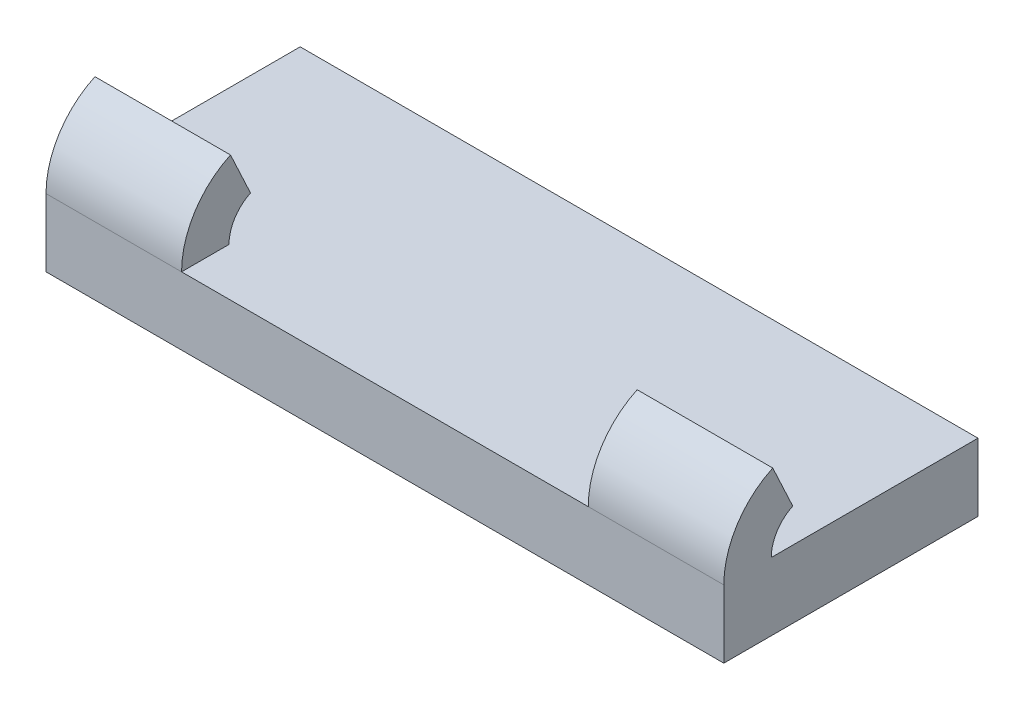
ISO-10303-21;
HEADER;
FILE_DESCRIPTION(('STEP AP214'),'2;1');
FILE_NAME('part.step','',(''),(''),'','','');
FILE_SCHEMA(('AUTOMOTIVE_DESIGN { 1 0 10303 214 1 1 1 1 }'));
ENDSEC;
DATA;
#1=APPLICATION_CONTEXT('core data for automotive mechanical design processes');
#2=APPLICATION_PROTOCOL_DEFINITION('international standard','automotive_design',2000,#1);
#3=PRODUCT_CONTEXT('',#1,'mechanical');
#4=PRODUCT('Part','Part','',(#3));
#5=PRODUCT_RELATED_PRODUCT_CATEGORY('part','',(#4));
#6=PRODUCT_DEFINITION_FORMATION('','',#4);
#7=PRODUCT_DEFINITION_CONTEXT('part definition',#1,'design');
#8=PRODUCT_DEFINITION('design','',#6,#7);
#9=PRODUCT_DEFINITION_SHAPE('','',#8);
#10=(LENGTH_UNIT() NAMED_UNIT(*) SI_UNIT(.MILLI.,.METRE.));
#11=(NAMED_UNIT(*) PLANE_ANGLE_UNIT() SI_UNIT($,.RADIAN.));
#12=(NAMED_UNIT(*) SI_UNIT($,.STERADIAN.) SOLID_ANGLE_UNIT());
#13=UNCERTAINTY_MEASURE_WITH_UNIT(LENGTH_MEASURE(1.E-05),#10,'distance_accuracy_value','');
#14=(GEOMETRIC_REPRESENTATION_CONTEXT(3) GLOBAL_UNCERTAINTY_ASSIGNED_CONTEXT((#13)) GLOBAL_UNIT_ASSIGNED_CONTEXT((#10,
#11,#12)) REPRESENTATION_CONTEXT('',''));
#15=CARTESIAN_POINT('',(0.,0.,0.));
#16=DIRECTION('',(0.,0.,1.));
#17=DIRECTION('',(1.,0.,0.));
#18=AXIS2_PLACEMENT_3D('',#15,#16,#17);
#19=CARTESIAN_POINT('',(0.,5.08,0.));
#20=DIRECTION('',(0.,1.,0.));
#21=DIRECTION('',(0.,0.,1.));
#22=AXIS2_PLACEMENT_3D('',#19,#20,#21);
#23=PLANE('',#22);
#24=DIRECTION('',(1.,0.,0.));
#25=VECTOR('',#24,1.);
#26=CARTESIAN_POINT('',(0.,5.08,19.05));
#27=LINE('',#26,#25);
#28=CARTESIAN_POINT('',(10.16,5.08,19.05));
#29=VERTEX_POINT('',#28);
#30=CARTESIAN_POINT('',(40.64,5.08,19.05));
#31=VERTEX_POINT('',#30);
#32=EDGE_CURVE('E132',#29,#31,#27,.T.);
#33=ORIENTED_EDGE('',*,*,#32,.T.);
#34=DIRECTION('',(0.,0.,1.));
#35=VECTOR('',#34,1.);
#36=CARTESIAN_POINT('',(40.64,5.08,15.494));
#37=LINE('',#36,#35);
#38=CARTESIAN_POINT('',(40.64,5.08,15.494));
#39=VERTEX_POINT('',#38);
#40=EDGE_CURVE('E121',#39,#31,#37,.T.);
#41=ORIENTED_EDGE('',*,*,#40,.F.);
#42=DIRECTION('',(-1.,0.,0.));
#43=VECTOR('',#42,1.);
#44=CARTESIAN_POINT('',(50.8,5.08,15.494));
#45=LINE('',#44,#43);
#46=CARTESIAN_POINT('',(50.8,5.08,15.494));
#47=VERTEX_POINT('',#46);
#48=EDGE_CURVE('E128',#47,#39,#45,.T.);
#49=ORIENTED_EDGE('',*,*,#48,.F.);
#50=DIRECTION('',(0.,0.,-1.));
#51=VECTOR('',#50,1.);
#52=CARTESIAN_POINT('',(50.8,5.08,0.));
#53=LINE('',#52,#51);
#54=CARTESIAN_POINT('',(50.8,5.08,0.));
#55=VERTEX_POINT('',#54);
#56=EDGE_CURVE('E186',#47,#55,#53,.T.);
#57=ORIENTED_EDGE('',*,*,#56,.T.);
#58=DIRECTION('',(-1.,0.,0.));
#59=VECTOR('',#58,1.);
#60=CARTESIAN_POINT('',(0.,5.08,0.));
#61=LINE('',#60,#59);
#62=CARTESIAN_POINT('',(0.,5.08,0.));
#63=VERTEX_POINT('',#62);
#64=EDGE_CURVE('E188',#55,#63,#61,.T.);
#65=ORIENTED_EDGE('',*,*,#64,.T.);
#66=DIRECTION('',(0.,0.,1.));
#67=VECTOR('',#66,1.);
#68=CARTESIAN_POINT('',(0.,5.08,0.));
#69=LINE('',#68,#67);
#70=CARTESIAN_POINT('',(0.,5.08,15.494));
#71=VERTEX_POINT('',#70);
#72=EDGE_CURVE('E180',#63,#71,#69,.T.);
#73=ORIENTED_EDGE('',*,*,#72,.T.);
#74=DIRECTION('',(-1.,0.,0.));
#75=VECTOR('',#74,1.);
#76=CARTESIAN_POINT('',(0.,5.08,15.494));
#77=LINE('',#76,#75);
#78=CARTESIAN_POINT('',(10.16,5.08,15.494));
#79=VERTEX_POINT('',#78);
#80=EDGE_CURVE('E152',#79,#71,#77,.T.);
#81=ORIENTED_EDGE('',*,*,#80,.F.);
#82=DIRECTION('',(0.,0.,-1.));
#83=VECTOR('',#82,1.);
#84=CARTESIAN_POINT('',(10.16,5.08,15.494));
#85=LINE('',#84,#83);
#86=EDGE_CURVE('E56',#29,#79,#85,.T.);
#87=ORIENTED_EDGE('',*,*,#86,.F.);
#88=EDGE_LOOP('',(#33,#41,#49,#57,#65,#73,#81,#87));
#89=FACE_BOUND('',#88,.T.);
#90=ADVANCED_FACE('F33',(#89),#23,.T.);
#91=CARTESIAN_POINT('',(0.,5.08,0.));
#92=DIRECTION('',(1.,0.,0.));
#93=DIRECTION('',(0.,0.,-1.));
#94=AXIS2_PLACEMENT_3D('',#91,#92,#93);
#95=PLANE('',#94);
#96=DIRECTION('',(0.,0.,1.));
#97=VECTOR('',#96,1.);
#98=CARTESIAN_POINT('',(0.,0.,0.));
#99=LINE('',#98,#97);
#100=CARTESIAN_POINT('',(0.,0.,0.));
#101=VERTEX_POINT('',#100);
#102=CARTESIAN_POINT('',(0.,0.,19.05));
#103=VERTEX_POINT('',#102);
#104=EDGE_CURVE('E179',#101,#103,#99,.T.);
#105=ORIENTED_EDGE('',*,*,#104,.T.);
#106=DIRECTION('',(0.,-1.,0.));
#107=VECTOR('',#106,1.);
#108=CARTESIAN_POINT('',(0.,5.08,19.05));
#109=LINE('',#108,#107);
#110=CARTESIAN_POINT('',(0.,5.08,19.05));
#111=VERTEX_POINT('',#110);
#112=EDGE_CURVE('E11',#111,#103,#109,.T.);
#113=ORIENTED_EDGE('',*,*,#112,.F.);
#114=CARTESIAN_POINT('',(0.,5.08,12.7));
#115=DIRECTION('',(1.,0.,0.));
#116=DIRECTION('',(0.,0.,-1.));
#117=AXIS2_PLACEMENT_3D('',#114,#115,#116);
#118=CIRCLE('',#117,6.35);
#119=CARTESIAN_POINT('',(0.,10.8350544476827,15.3836259620534));
#120=VERTEX_POINT('',#119);
#121=EDGE_CURVE('E176',#120,#111,#118,.T.);
#122=ORIENTED_EDGE('',*,*,#121,.F.);
#123=DIRECTION('',(0.,0.906307787036651,0.422618261740697));
#124=VECTOR('',#123,1.);
#125=CARTESIAN_POINT('',(0.,7.6122239569804,13.8807954233035));
#126=LINE('',#125,#124);
#127=CARTESIAN_POINT('',(0.,7.6122239569804,13.8807954233035));
#128=VERTEX_POINT('',#127);
#129=EDGE_CURVE('E155',#128,#120,#126,.T.);
#130=ORIENTED_EDGE('',*,*,#129,.F.);
#131=CARTESIAN_POINT('',(0.,5.08,12.7));
#132=DIRECTION('',(1.,0.,0.));
#133=DIRECTION('',(0.,0.,-1.));
#134=AXIS2_PLACEMENT_3D('',#131,#132,#133);
#135=CIRCLE('',#134,2.794);
#136=EDGE_CURVE('E167',#128,#71,#135,.T.);
#137=ORIENTED_EDGE('',*,*,#136,.T.);
#138=ORIENTED_EDGE('',*,*,#72,.F.);
#139=DIRECTION('',(0.,-1.,0.));
#140=VECTOR('',#139,1.);
#141=CARTESIAN_POINT('',(0.,5.08,0.));
#142=LINE('',#141,#140);
#143=EDGE_CURVE('E190',#63,#101,#142,.T.);
#144=ORIENTED_EDGE('',*,*,#143,.T.);
#145=EDGE_LOOP('',(#105,#113,#122,#130,#137,#138,#144));
#146=FACE_BOUND('',#145,.T.);
#147=ADVANCED_FACE('F35',(#146),#95,.F.);
#148=CARTESIAN_POINT('',(0.,5.08,19.05));
#149=DIRECTION('',(0.,0.,-1.));
#150=DIRECTION('',(-1.,0.,0.));
#151=AXIS2_PLACEMENT_3D('',#148,#149,#150);
#152=PLANE('',#151);
#153=DIRECTION('',(1.,0.,0.));
#154=VECTOR('',#153,1.);
#155=CARTESIAN_POINT('',(0.,0.,19.05));
#156=LINE('',#155,#154);
#157=CARTESIAN_POINT('',(50.8,0.,19.05));
#158=VERTEX_POINT('',#157);
#159=EDGE_CURVE('E193',#103,#158,#156,.T.);
#160=ORIENTED_EDGE('',*,*,#159,.T.);
#161=DIRECTION('',(0.,-1.,0.));
#162=VECTOR('',#161,1.);
#163=CARTESIAN_POINT('',(50.8,5.08,19.05));
#164=LINE('',#163,#162);
#165=CARTESIAN_POINT('',(50.8,5.08,19.05));
#166=VERTEX_POINT('',#165);
#167=EDGE_CURVE('E41',#166,#158,#164,.T.);
#168=ORIENTED_EDGE('',*,*,#167,.F.);
#169=DIRECTION('',(1.,0.,0.));
#170=VECTOR('',#169,1.);
#171=CARTESIAN_POINT('',(50.8,5.08,19.05));
#172=LINE('',#171,#170);
#173=EDGE_CURVE('E133',#31,#166,#172,.T.);
#174=ORIENTED_EDGE('',*,*,#173,.F.);
#175=ORIENTED_EDGE('',*,*,#32,.F.);
#176=EDGE_CURVE('E183',#111,#29,#27,.T.);
#177=ORIENTED_EDGE('',*,*,#176,.F.);
#178=ORIENTED_EDGE('',*,*,#112,.T.);
#179=EDGE_LOOP('',(#160,#168,#174,#175,#177,#178));
#180=FACE_BOUND('',#179,.T.);
#181=ADVANCED_FACE('F227',(#180),#152,.F.);
#182=CARTESIAN_POINT('',(50.8,5.08,0.));
#183=DIRECTION('',(-1.,0.,0.));
#184=DIRECTION('',(0.,0.,1.));
#185=AXIS2_PLACEMENT_3D('',#182,#183,#184);
#186=PLANE('',#185);
#187=DIRECTION('',(0.,0.,-1.));
#188=VECTOR('',#187,1.);
#189=CARTESIAN_POINT('',(50.8,0.,0.));
#190=LINE('',#189,#188);
#191=CARTESIAN_POINT('',(50.8,0.,0.));
#192=VERTEX_POINT('',#191);
#193=EDGE_CURVE('E195',#158,#192,#190,.T.);
#194=ORIENTED_EDGE('',*,*,#193,.T.);
#195=DIRECTION('',(0.,-1.,0.));
#196=VECTOR('',#195,1.);
#197=CARTESIAN_POINT('',(50.8,5.08,0.));
#198=LINE('',#197,#196);
#199=EDGE_CURVE('E200',#55,#192,#198,.T.);
#200=ORIENTED_EDGE('',*,*,#199,.F.);
#201=ORIENTED_EDGE('',*,*,#56,.F.);
#202=CARTESIAN_POINT('',(50.8,5.08,12.7));
#203=DIRECTION('',(1.,0.,0.));
#204=DIRECTION('',(0.,0.,-1.));
#205=AXIS2_PLACEMENT_3D('',#202,#203,#204);
#206=CIRCLE('',#205,2.794);
#207=CARTESIAN_POINT('',(50.8,7.6122239569804,13.8807954233035));
#208=VERTEX_POINT('',#207);
#209=EDGE_CURVE('E48',#208,#47,#206,.T.);
#210=ORIENTED_EDGE('',*,*,#209,.F.);
#211=DIRECTION('',(0.,-0.906307787036651,-0.422618261740697));
#212=VECTOR('',#211,1.);
#213=CARTESIAN_POINT('',(50.8,7.6122239569804,13.8807954233035));
#214=LINE('',#213,#212);
#215=CARTESIAN_POINT('',(50.8,10.8350544476827,15.3836259620534));
#216=VERTEX_POINT('',#215);
#217=EDGE_CURVE('E136',#216,#208,#214,.T.);
#218=ORIENTED_EDGE('',*,*,#217,.F.);
#219=CARTESIAN_POINT('',(50.8,5.08,12.7));
#220=DIRECTION('',(1.,0.,0.));
#221=DIRECTION('',(0.,0.,-1.));
#222=AXIS2_PLACEMENT_3D('',#219,#220,#221);
#223=CIRCLE('',#222,6.35);
#224=EDGE_CURVE('E149',#216,#166,#223,.T.);
#225=ORIENTED_EDGE('',*,*,#224,.T.);
#226=ORIENTED_EDGE('',*,*,#167,.T.);
#227=EDGE_LOOP('',(#194,#200,#201,#210,#218,#225,#226));
#228=FACE_BOUND('',#227,.T.);
#229=ADVANCED_FACE('F206',(#228),#186,.F.);
#230=CARTESIAN_POINT('',(0.,5.08,0.));
#231=DIRECTION('',(0.,0.,1.));
#232=DIRECTION('',(1.,0.,0.));
#233=AXIS2_PLACEMENT_3D('',#230,#231,#232);
#234=PLANE('',#233);
#235=DIRECTION('',(-1.,0.,0.));
#236=VECTOR('',#235,1.);
#237=CARTESIAN_POINT('',(0.,0.,0.));
#238=LINE('',#237,#236);
#239=EDGE_CURVE('E182',#192,#101,#238,.T.);
#240=ORIENTED_EDGE('',*,*,#239,.T.);
#241=ORIENTED_EDGE('',*,*,#143,.F.);
#242=ORIENTED_EDGE('',*,*,#64,.F.);
#243=ORIENTED_EDGE('',*,*,#199,.T.);
#244=EDGE_LOOP('',(#240,#241,#242,#243));
#245=FACE_BOUND('',#244,.T.);
#246=ADVANCED_FACE('F216',(#245),#234,.F.);
#247=CARTESIAN_POINT('',(0.,0.,0.));
#248=DIRECTION('',(0.,1.,0.));
#249=DIRECTION('',(0.,0.,1.));
#250=AXIS2_PLACEMENT_3D('',#247,#248,#249);
#251=PLANE('',#250);
#252=ORIENTED_EDGE('',*,*,#104,.F.);
#253=ORIENTED_EDGE('',*,*,#239,.F.);
#254=ORIENTED_EDGE('',*,*,#193,.F.);
#255=ORIENTED_EDGE('',*,*,#159,.F.);
#256=EDGE_LOOP('',(#252,#253,#254,#255));
#257=FACE_BOUND('',#256,.T.);
#258=ADVANCED_FACE('F213',(#257),#251,.F.);
#259=CARTESIAN_POINT('',(0.,5.08,12.7));
#260=DIRECTION('',(1.,0.,0.));
#261=DIRECTION('',(0.,0.,-1.));
#262=AXIS2_PLACEMENT_3D('',#259,#260,#261);
#263=CYLINDRICAL_SURFACE('',#262,6.35);
#264=CARTESIAN_POINT('',(10.16,5.08,12.7));
#265=DIRECTION('',(1.,0.,0.));
#266=DIRECTION('',(0.,0.,-1.));
#267=AXIS2_PLACEMENT_3D('',#264,#265,#266);
#268=CIRCLE('',#267,6.35);
#269=CARTESIAN_POINT('',(10.16,10.8350544476827,15.3836259620534));
#270=VERTEX_POINT('',#269);
#271=EDGE_CURVE('E173',#270,#29,#268,.T.);
#272=ORIENTED_EDGE('',*,*,#271,.F.);
#273=DIRECTION('',(1.,0.,0.));
#274=VECTOR('',#273,1.);
#275=CARTESIAN_POINT('',(0.,10.8350544476827,15.3836259620534));
#276=LINE('',#275,#274);
#277=EDGE_CURVE('E158',#120,#270,#276,.T.);
#278=ORIENTED_EDGE('',*,*,#277,.F.);
#279=ORIENTED_EDGE('',*,*,#121,.T.);
#280=ORIENTED_EDGE('',*,*,#176,.T.);
#281=EDGE_LOOP('',(#272,#278,#279,#280));
#282=FACE_BOUND('',#281,.T.);
#283=ADVANCED_FACE('F233',(#282),#263,.T.);
#284=CARTESIAN_POINT('',(10.16,7.6122239569804,13.8807954233035));
#285=DIRECTION('',(-1.,0.,0.));
#286=DIRECTION('',(0.,0.,1.));
#287=AXIS2_PLACEMENT_3D('',#284,#285,#286);
#288=PLANE('',#287);
#289=CARTESIAN_POINT('',(10.16,5.08,12.7));
#290=DIRECTION('',(1.,0.,0.));
#291=DIRECTION('',(0.,0.,-1.));
#292=AXIS2_PLACEMENT_3D('',#289,#290,#291);
#293=CIRCLE('',#292,2.794);
#294=CARTESIAN_POINT('',(10.16,7.6122239569804,13.8807954233035));
#295=VERTEX_POINT('',#294);
#296=EDGE_CURVE('E170',#295,#79,#293,.T.);
#297=ORIENTED_EDGE('',*,*,#296,.F.);
#298=DIRECTION('',(0.,-0.906307787036651,-0.422618261740697));
#299=VECTOR('',#298,1.);
#300=CARTESIAN_POINT('',(10.16,7.6122239569804,13.8807954233035));
#301=LINE('',#300,#299);
#302=EDGE_CURVE('E161',#270,#295,#301,.T.);
#303=ORIENTED_EDGE('',*,*,#302,.F.);
#304=ORIENTED_EDGE('',*,*,#271,.T.);
#305=ORIENTED_EDGE('',*,*,#86,.T.);
#306=EDGE_LOOP('',(#297,#303,#304,#305));
#307=FACE_BOUND('',#306,.T.);
#308=ADVANCED_FACE('F230',(#307),#288,.F.);
#309=CARTESIAN_POINT('',(0.,5.08,12.7));
#310=DIRECTION('',(1.,0.,0.));
#311=DIRECTION('',(0.,0.,-1.));
#312=AXIS2_PLACEMENT_3D('',#309,#310,#311);
#313=CYLINDRICAL_SURFACE('',#312,2.794);
#314=DIRECTION('',(-1.,0.,0.));
#315=VECTOR('',#314,1.);
#316=CARTESIAN_POINT('',(0.,7.6122239569804,13.8807954233035));
#317=LINE('',#316,#315);
#318=EDGE_CURVE('E164',#295,#128,#317,.T.);
#319=ORIENTED_EDGE('',*,*,#318,.F.);
#320=ORIENTED_EDGE('',*,*,#296,.T.);
#321=ORIENTED_EDGE('',*,*,#80,.T.);
#322=ORIENTED_EDGE('',*,*,#136,.F.);
#323=EDGE_LOOP('',(#319,#320,#321,#322));
#324=FACE_BOUND('',#323,.T.);
#325=ADVANCED_FACE('F238',(#324),#313,.F.);
#326=CARTESIAN_POINT('',(0.,-6.43010889536547,7.33274807589315));
#327=DIRECTION('',(0.,0.422618261740697,-0.906307787036651));
#328=DIRECTION('',(0.,0.906307787036651,0.422618261740697));
#329=AXIS2_PLACEMENT_3D('',#326,#327,#328);
#330=PLANE('',#329);
#331=ORIENTED_EDGE('',*,*,#129,.T.);
#332=ORIENTED_EDGE('',*,*,#277,.T.);
#333=ORIENTED_EDGE('',*,*,#302,.T.);
#334=ORIENTED_EDGE('',*,*,#318,.T.);
#335=EDGE_LOOP('',(#331,#332,#333,#334));
#336=FACE_BOUND('',#335,.T.);
#337=ADVANCED_FACE('F235',(#336),#330,.T.);
#338=CARTESIAN_POINT('',(0.,5.08,12.7));
#339=DIRECTION('',(1.,0.,0.));
#340=DIRECTION('',(0.,0.,-1.));
#341=AXIS2_PLACEMENT_3D('',#338,#339,#340);
#342=CYLINDRICAL_SURFACE('',#341,6.35);
#343=CARTESIAN_POINT('',(40.64,5.08,12.7));
#344=DIRECTION('',(1.,0.,0.));
#345=DIRECTION('',(0.,0.,-1.));
#346=AXIS2_PLACEMENT_3D('',#343,#344,#345);
#347=CIRCLE('',#346,6.35);
#348=CARTESIAN_POINT('',(40.64,10.8350544476827,15.3836259620534));
#349=VERTEX_POINT('',#348);
#350=EDGE_CURVE('E126',#349,#31,#347,.T.);
#351=ORIENTED_EDGE('',*,*,#350,.T.);
#352=ORIENTED_EDGE('',*,*,#173,.T.);
#353=ORIENTED_EDGE('',*,*,#224,.F.);
#354=DIRECTION('',(1.,0.,0.));
#355=VECTOR('',#354,1.);
#356=CARTESIAN_POINT('',(50.8,10.8350544476827,15.3836259620534));
#357=LINE('',#356,#355);
#358=EDGE_CURVE('E144',#349,#216,#357,.T.);
#359=ORIENTED_EDGE('',*,*,#358,.F.);
#360=EDGE_LOOP('',(#351,#352,#353,#359));
#361=FACE_BOUND('',#360,.T.);
#362=ADVANCED_FACE('F226',(#361),#342,.T.);
#363=CARTESIAN_POINT('',(40.64,7.61222395698041,13.8807954233035));
#364=DIRECTION('',(1.,0.,0.));
#365=DIRECTION('',(0.,0.,-1.));
#366=AXIS2_PLACEMENT_3D('',#363,#364,#365);
#367=PLANE('',#366);
#368=CARTESIAN_POINT('',(40.64,5.08,12.7));
#369=DIRECTION('',(1.,0.,0.));
#370=DIRECTION('',(0.,0.,-1.));
#371=AXIS2_PLACEMENT_3D('',#368,#369,#370);
#372=CIRCLE('',#371,2.794);
#373=CARTESIAN_POINT('',(40.64,7.61222395698041,13.8807954233035));
#374=VERTEX_POINT('',#373);
#375=EDGE_CURVE('E118',#374,#39,#372,.T.);
#376=ORIENTED_EDGE('',*,*,#375,.T.);
#377=ORIENTED_EDGE('',*,*,#40,.T.);
#378=ORIENTED_EDGE('',*,*,#350,.F.);
#379=DIRECTION('',(0.,0.906307787036651,0.422618261740697));
#380=VECTOR('',#379,1.);
#381=CARTESIAN_POINT('',(40.64,7.61222395698041,13.8807954233035));
#382=LINE('',#381,#380);
#383=EDGE_CURVE('E124',#374,#349,#382,.T.);
#384=ORIENTED_EDGE('',*,*,#383,.F.);
#385=EDGE_LOOP('',(#376,#377,#378,#384));
#386=FACE_BOUND('',#385,.T.);
#387=ADVANCED_FACE('F119',(#386),#367,.F.);
#388=CARTESIAN_POINT('',(0.,5.08,12.7));
#389=DIRECTION('',(1.,0.,0.));
#390=DIRECTION('',(0.,0.,-1.));
#391=AXIS2_PLACEMENT_3D('',#388,#389,#390);
#392=CYLINDRICAL_SURFACE('',#391,2.794);
#393=DIRECTION('',(-1.,0.,0.));
#394=VECTOR('',#393,1.);
#395=CARTESIAN_POINT('',(50.8,7.6122239569804,13.8807954233035));
#396=LINE('',#395,#394);
#397=EDGE_CURVE('E141',#208,#374,#396,.T.);
#398=ORIENTED_EDGE('',*,*,#397,.F.);
#399=ORIENTED_EDGE('',*,*,#209,.T.);
#400=ORIENTED_EDGE('',*,*,#48,.T.);
#401=ORIENTED_EDGE('',*,*,#375,.F.);
#402=EDGE_LOOP('',(#398,#399,#400,#401));
#403=FACE_BOUND('',#402,.T.);
#404=ADVANCED_FACE('F129',(#403),#392,.F.);
#405=CARTESIAN_POINT('',(0.,-6.43010889536547,7.33274807589315));
#406=DIRECTION('',(0.,-0.422618261740697,0.906307787036651));
#407=DIRECTION('',(0.,-0.906307787036651,-0.422618261740697));
#408=AXIS2_PLACEMENT_3D('',#405,#406,#407);
#409=PLANE('',#408);
#410=ORIENTED_EDGE('',*,*,#217,.T.);
#411=ORIENTED_EDGE('',*,*,#397,.T.);
#412=ORIENTED_EDGE('',*,*,#383,.T.);
#413=ORIENTED_EDGE('',*,*,#358,.T.);
#414=EDGE_LOOP('',(#410,#411,#412,#413));
#415=FACE_BOUND('',#414,.T.);
#416=ADVANCED_FACE('F223',(#415),#409,.F.);
#417=CLOSED_SHELL('',(#90,#147,#181,#229,#246,#258,#283,#308,#325,#337,#362,#387,#404,#416));
#418=MANIFOLD_SOLID_BREP('B2',#417);
#419=ADVANCED_BREP_SHAPE_REPRESENTATION('',(#18,#418),#14);
#420=SHAPE_DEFINITION_REPRESENTATION(#9,#419);
ENDSEC;
END-ISO-10303-21;
